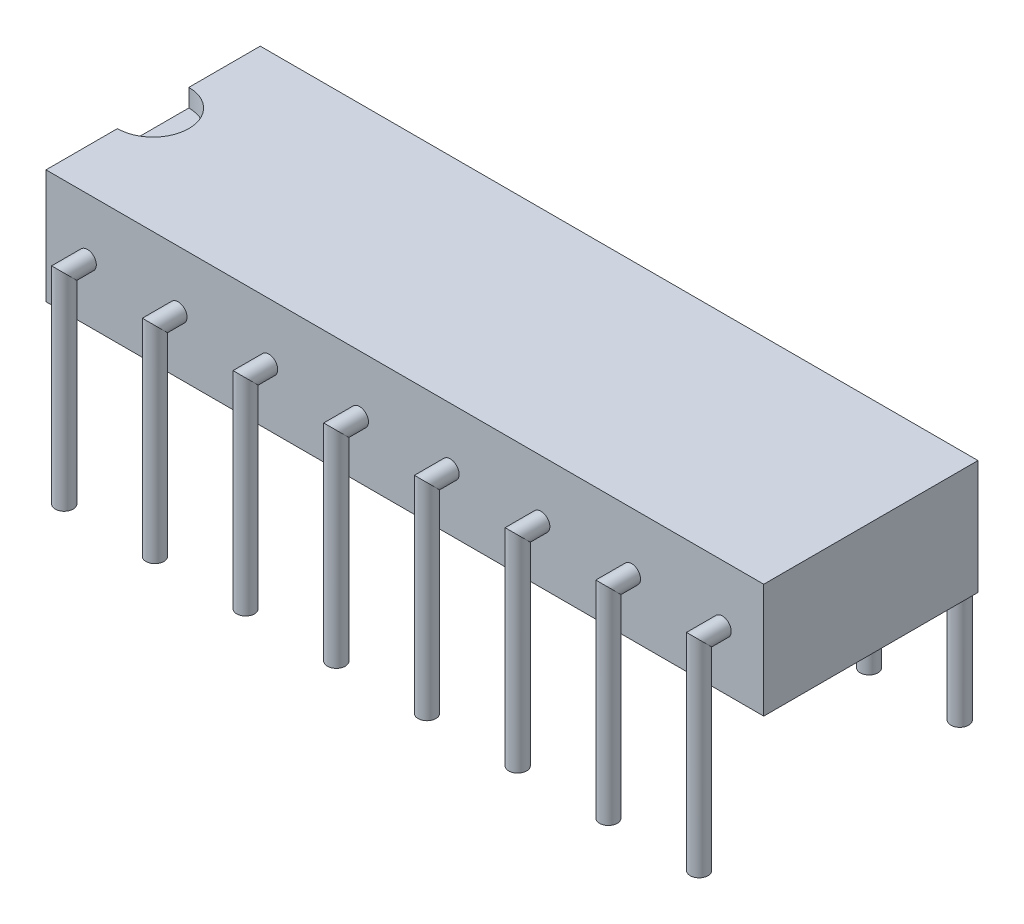
ISO-10303-21;
HEADER;
FILE_DESCRIPTION(('STEP AP214'),'2;1');
FILE_NAME('part.step','',(''),(''),'','','');
FILE_SCHEMA(('AUTOMOTIVE_DESIGN { 1 0 10303 214 1 1 1 1 }'));
ENDSEC;
DATA;
#1=APPLICATION_CONTEXT('core data for automotive mechanical design processes');
#2=APPLICATION_PROTOCOL_DEFINITION('international standard','automotive_design',2000,#1);
#3=PRODUCT_CONTEXT('',#1,'mechanical');
#4=PRODUCT('Part','Part','',(#3));
#5=PRODUCT_RELATED_PRODUCT_CATEGORY('part','',(#4));
#6=PRODUCT_DEFINITION_FORMATION('','',#4);
#7=PRODUCT_DEFINITION_CONTEXT('part definition',#1,'design');
#8=PRODUCT_DEFINITION('design','',#6,#7);
#9=PRODUCT_DEFINITION_SHAPE('','',#8);
#10=(LENGTH_UNIT() NAMED_UNIT(*) SI_UNIT(.MILLI.,.METRE.));
#11=(NAMED_UNIT(*) PLANE_ANGLE_UNIT() SI_UNIT($,.RADIAN.));
#12=(NAMED_UNIT(*) SI_UNIT($,.STERADIAN.) SOLID_ANGLE_UNIT());
#13=UNCERTAINTY_MEASURE_WITH_UNIT(LENGTH_MEASURE(1.E-05),#10,'distance_accuracy_value','');
#14=(GEOMETRIC_REPRESENTATION_CONTEXT(3) GLOBAL_UNCERTAINTY_ASSIGNED_CONTEXT((#13)) GLOBAL_UNIT_ASSIGNED_CONTEXT((#10,
#11,#12)) REPRESENTATION_CONTEXT('',''));
#15=CARTESIAN_POINT('',(0.,0.,0.));
#16=DIRECTION('',(0.,0.,1.));
#17=DIRECTION('',(1.,0.,0.));
#18=AXIS2_PLACEMENT_3D('',#15,#16,#17);
#19=CARTESIAN_POINT('',(20.1,3.2,3.));
#20=DIRECTION('',(0.,0.,-1.));
#21=DIRECTION('',(-1.,0.,0.));
#22=AXIS2_PLACEMENT_3D('',#19,#20,#21);
#23=PLANE('',#22);
#24=CARTESIAN_POINT('',(16.4,1.6,3.));
#25=DIRECTION('',(0.,0.,-1.));
#26=DIRECTION('',(-1.,0.,0.));
#27=AXIS2_PLACEMENT_3D('',#24,#25,#26);
#28=CIRCLE('',#27,0.25);
#29=CARTESIAN_POINT('',(16.15,1.6,3.));
#30=VERTEX_POINT('',#29);
#31=EDGE_CURVE('E57',#30,#30,#28,.F.);
#32=ORIENTED_EDGE('',*,*,#31,.F.);
#33=EDGE_LOOP('',(#32));
#34=FACE_BOUND('',#33,.T.);
#35=CARTESIAN_POINT('',(11.32,1.6,3.));
#36=DIRECTION('',(0.,0.,-1.));
#37=DIRECTION('',(-1.,0.,0.));
#38=AXIS2_PLACEMENT_3D('',#35,#36,#37);
#39=CIRCLE('',#38,0.25);
#40=CARTESIAN_POINT('',(11.07,1.6,3.));
#41=VERTEX_POINT('',#40);
#42=EDGE_CURVE('E160',#41,#41,#39,.F.);
#43=ORIENTED_EDGE('',*,*,#42,.F.);
#44=EDGE_LOOP('',(#43));
#45=FACE_BOUND('',#44,.T.);
#46=CARTESIAN_POINT('',(6.24,1.6,3.));
#47=DIRECTION('',(0.,0.,-1.));
#48=DIRECTION('',(-1.,0.,0.));
#49=AXIS2_PLACEMENT_3D('',#46,#47,#48);
#50=CIRCLE('',#49,0.25);
#51=CARTESIAN_POINT('',(5.99,1.6,3.));
#52=VERTEX_POINT('',#51);
#53=EDGE_CURVE('E154',#52,#52,#50,.F.);
#54=ORIENTED_EDGE('',*,*,#53,.F.);
#55=EDGE_LOOP('',(#54));
#56=FACE_BOUND('',#55,.T.);
#57=CARTESIAN_POINT('',(1.16,1.6,3.));
#58=DIRECTION('',(0.,0.,-1.));
#59=DIRECTION('',(-1.,0.,0.));
#60=AXIS2_PLACEMENT_3D('',#57,#58,#59);
#61=CIRCLE('',#60,0.25);
#62=CARTESIAN_POINT('',(0.91,1.6,3.));
#63=VERTEX_POINT('',#62);
#64=EDGE_CURVE('E148',#63,#63,#61,.F.);
#65=ORIENTED_EDGE('',*,*,#64,.F.);
#66=EDGE_LOOP('',(#65));
#67=FACE_BOUND('',#66,.T.);
#68=DIRECTION('',(0.,-1.,0.));
#69=VECTOR('',#68,1.);
#70=CARTESIAN_POINT('',(0.,3.2,3.));
#71=LINE('',#70,#69);
#72=CARTESIAN_POINT('',(0.,3.2,3.));
#73=VERTEX_POINT('',#72);
#74=CARTESIAN_POINT('',(0.,0.,3.));
#75=VERTEX_POINT('',#74);
#76=EDGE_CURVE('E184',#73,#75,#71,.T.);
#77=ORIENTED_EDGE('',*,*,#76,.T.);
#78=DIRECTION('',(-1.,0.,0.));
#79=VECTOR('',#78,1.);
#80=CARTESIAN_POINT('',(20.1,0.,3.));
#81=LINE('',#80,#79);
#82=CARTESIAN_POINT('',(20.1,0.,3.));
#83=VERTEX_POINT('',#82);
#84=EDGE_CURVE('E145',#83,#75,#81,.T.);
#85=ORIENTED_EDGE('',*,*,#84,.F.);
#86=DIRECTION('',(0.,-1.,0.));
#87=VECTOR('',#86,1.);
#88=CARTESIAN_POINT('',(20.1,3.2,3.));
#89=LINE('',#88,#87);
#90=CARTESIAN_POINT('',(20.1,3.2,3.));
#91=VERTEX_POINT('',#90);
#92=EDGE_CURVE('E125',#91,#83,#89,.T.);
#93=ORIENTED_EDGE('',*,*,#92,.F.);
#94=DIRECTION('',(-1.,0.,0.));
#95=VECTOR('',#94,1.);
#96=CARTESIAN_POINT('',(20.1,3.2,3.));
#97=LINE('',#96,#95);
#98=EDGE_CURVE('E138',#91,#73,#97,.T.);
#99=ORIENTED_EDGE('',*,*,#98,.T.);
#100=EDGE_LOOP('',(#77,#85,#93,#99));
#101=FACE_BOUND('',#100,.T.);
#102=CARTESIAN_POINT('',(3.7,1.6,3.));
#103=DIRECTION('',(0.,0.,-1.));
#104=DIRECTION('',(-1.,0.,0.));
#105=AXIS2_PLACEMENT_3D('',#102,#103,#104);
#106=CIRCLE('',#105,0.25);
#107=CARTESIAN_POINT('',(3.45,1.6,3.));
#108=VERTEX_POINT('',#107);
#109=EDGE_CURVE('E151',#108,#108,#106,.F.);
#110=ORIENTED_EDGE('',*,*,#109,.F.);
#111=EDGE_LOOP('',(#110));
#112=FACE_BOUND('',#111,.T.);
#113=CARTESIAN_POINT('',(8.78,1.6,3.));
#114=DIRECTION('',(0.,0.,-1.));
#115=DIRECTION('',(-1.,0.,0.));
#116=AXIS2_PLACEMENT_3D('',#113,#114,#115);
#117=CIRCLE('',#116,0.25);
#118=CARTESIAN_POINT('',(8.53,1.6,3.));
#119=VERTEX_POINT('',#118);
#120=EDGE_CURVE('E157',#119,#119,#117,.F.);
#121=ORIENTED_EDGE('',*,*,#120,.F.);
#122=EDGE_LOOP('',(#121));
#123=FACE_BOUND('',#122,.T.);
#124=CARTESIAN_POINT('',(13.86,1.6,3.));
#125=DIRECTION('',(0.,0.,-1.));
#126=DIRECTION('',(-1.,0.,0.));
#127=AXIS2_PLACEMENT_3D('',#124,#125,#126);
#128=CIRCLE('',#127,0.25);
#129=CARTESIAN_POINT('',(13.61,1.6,3.));
#130=VERTEX_POINT('',#129);
#131=EDGE_CURVE('E163',#130,#130,#128,.F.);
#132=ORIENTED_EDGE('',*,*,#131,.F.);
#133=EDGE_LOOP('',(#132));
#134=FACE_BOUND('',#133,.T.);
#135=CARTESIAN_POINT('',(18.94,1.6,3.));
#136=DIRECTION('',(0.,0.,-1.));
#137=DIRECTION('',(-1.,0.,0.));
#138=AXIS2_PLACEMENT_3D('',#135,#136,#137);
#139=CIRCLE('',#138,0.25);
#140=CARTESIAN_POINT('',(18.69,1.6,3.));
#141=VERTEX_POINT('',#140);
#142=EDGE_CURVE('E12',#141,#141,#139,.F.);
#143=ORIENTED_EDGE('',*,*,#142,.F.);
#144=EDGE_LOOP('',(#143));
#145=FACE_BOUND('',#144,.T.);
#146=ADVANCED_FACE('F50',(#34,#45,#56,#67,#101,#112,#123,#134,#145),#23,.F.);
#147=CARTESIAN_POINT('',(20.1,0.,3.));
#148=DIRECTION('',(0.,1.,0.));
#149=DIRECTION('',(0.,0.,1.));
#150=AXIS2_PLACEMENT_3D('',#147,#148,#149);
#151=PLANE('',#150);
#152=DIRECTION('',(0.,0.,-1.));
#153=VECTOR('',#152,1.);
#154=CARTESIAN_POINT('',(0.,0.,3.));
#155=LINE('',#154,#153);
#156=CARTESIAN_POINT('',(0.,0.,-3.));
#157=VERTEX_POINT('',#156);
#158=EDGE_CURVE('E266',#75,#157,#155,.T.);
#159=ORIENTED_EDGE('',*,*,#158,.T.);
#160=DIRECTION('',(-1.,0.,0.));
#161=VECTOR('',#160,1.);
#162=CARTESIAN_POINT('',(20.1,0.,-3.));
#163=LINE('',#162,#161);
#164=CARTESIAN_POINT('',(20.1,0.,-3.));
#165=VERTEX_POINT('',#164);
#166=EDGE_CURVE('E142',#165,#157,#163,.T.);
#167=ORIENTED_EDGE('',*,*,#166,.F.);
#168=DIRECTION('',(0.,0.,-1.));
#169=VECTOR('',#168,1.);
#170=CARTESIAN_POINT('',(20.1,0.,3.));
#171=LINE('',#170,#169);
#172=EDGE_CURVE('E128',#83,#165,#171,.T.);
#173=ORIENTED_EDGE('',*,*,#172,.F.);
#174=ORIENTED_EDGE('',*,*,#84,.T.);
#175=EDGE_LOOP('',(#159,#167,#173,#174));
#176=FACE_BOUND('',#175,.T.);
#177=ADVANCED_FACE('F173',(#176),#151,.F.);
#178=CARTESIAN_POINT('',(20.1,3.2,-3.));
#179=DIRECTION('',(0.,0.,1.));
#180=DIRECTION('',(1.,0.,0.));
#181=AXIS2_PLACEMENT_3D('',#178,#179,#180);
#182=PLANE('',#181);
#183=CARTESIAN_POINT('',(18.94,1.6,-3.));
#184=DIRECTION('',(0.,0.,1.));
#185=DIRECTION('',(1.,0.,0.));
#186=AXIS2_PLACEMENT_3D('',#183,#184,#185);
#187=CIRCLE('',#186,0.25);
#188=CARTESIAN_POINT('',(19.19,1.6,-3.));
#189=VERTEX_POINT('',#188);
#190=EDGE_CURVE('E813',#189,#189,#187,.T.);
#191=ORIENTED_EDGE('',*,*,#190,.T.);
#192=EDGE_LOOP('',(#191));
#193=FACE_BOUND('',#192,.T.);
#194=CARTESIAN_POINT('',(16.4,1.6,-3.));
#195=DIRECTION('',(0.,0.,1.));
#196=DIRECTION('',(1.,0.,0.));
#197=AXIS2_PLACEMENT_3D('',#194,#195,#196);
#198=CIRCLE('',#197,0.25);
#199=CARTESIAN_POINT('',(16.65,1.6,-3.));
#200=VERTEX_POINT('',#199);
#201=EDGE_CURVE('E806',#200,#200,#198,.T.);
#202=ORIENTED_EDGE('',*,*,#201,.T.);
#203=EDGE_LOOP('',(#202));
#204=FACE_BOUND('',#203,.T.);
#205=CARTESIAN_POINT('',(13.86,1.6,-3.));
#206=DIRECTION('',(0.,0.,1.));
#207=DIRECTION('',(1.,0.,0.));
#208=AXIS2_PLACEMENT_3D('',#205,#206,#207);
#209=CIRCLE('',#208,0.25);
#210=CARTESIAN_POINT('',(14.11,1.6,-3.));
#211=VERTEX_POINT('',#210);
#212=EDGE_CURVE('E822',#211,#211,#209,.T.);
#213=ORIENTED_EDGE('',*,*,#212,.T.);
#214=EDGE_LOOP('',(#213));
#215=FACE_BOUND('',#214,.T.);
#216=CARTESIAN_POINT('',(11.32,1.6,-3.));
#217=DIRECTION('',(0.,0.,1.));
#218=DIRECTION('',(1.,0.,0.));
#219=AXIS2_PLACEMENT_3D('',#216,#217,#218);
#220=CIRCLE('',#219,0.25);
#221=CARTESIAN_POINT('',(11.57,1.6,-3.));
#222=VERTEX_POINT('',#221);
#223=EDGE_CURVE('E831',#222,#222,#220,.T.);
#224=ORIENTED_EDGE('',*,*,#223,.T.);
#225=EDGE_LOOP('',(#224));
#226=FACE_BOUND('',#225,.T.);
#227=CARTESIAN_POINT('',(8.78,1.6,-3.));
#228=DIRECTION('',(0.,0.,1.));
#229=DIRECTION('',(1.,0.,0.));
#230=AXIS2_PLACEMENT_3D('',#227,#228,#229);
#231=CIRCLE('',#230,0.25);
#232=CARTESIAN_POINT('',(9.03,1.6,-3.));
#233=VERTEX_POINT('',#232);
#234=EDGE_CURVE('E840',#233,#233,#231,.T.);
#235=ORIENTED_EDGE('',*,*,#234,.T.);
#236=EDGE_LOOP('',(#235));
#237=FACE_BOUND('',#236,.T.);
#238=CARTESIAN_POINT('',(6.24,1.6,-3.));
#239=DIRECTION('',(0.,0.,1.));
#240=DIRECTION('',(1.,0.,0.));
#241=AXIS2_PLACEMENT_3D('',#238,#239,#240);
#242=CIRCLE('',#241,0.25);
#243=CARTESIAN_POINT('',(6.49,1.6,-3.));
#244=VERTEX_POINT('',#243);
#245=EDGE_CURVE('E849',#244,#244,#242,.T.);
#246=ORIENTED_EDGE('',*,*,#245,.T.);
#247=EDGE_LOOP('',(#246));
#248=FACE_BOUND('',#247,.T.);
#249=CARTESIAN_POINT('',(3.7,1.6,-3.));
#250=DIRECTION('',(0.,0.,1.));
#251=DIRECTION('',(1.,0.,0.));
#252=AXIS2_PLACEMENT_3D('',#249,#250,#251);
#253=CIRCLE('',#252,0.25);
#254=CARTESIAN_POINT('',(3.95,1.6,-3.));
#255=VERTEX_POINT('',#254);
#256=EDGE_CURVE('E858',#255,#255,#253,.T.);
#257=ORIENTED_EDGE('',*,*,#256,.T.);
#258=EDGE_LOOP('',(#257));
#259=FACE_BOUND('',#258,.T.);
#260=CARTESIAN_POINT('',(1.16,1.6,-3.));
#261=DIRECTION('',(0.,0.,1.));
#262=DIRECTION('',(1.,0.,0.));
#263=AXIS2_PLACEMENT_3D('',#260,#261,#262);
#264=CIRCLE('',#263,0.25);
#265=CARTESIAN_POINT('',(1.41,1.6,-3.));
#266=VERTEX_POINT('',#265);
#267=EDGE_CURVE('E249',#266,#266,#264,.T.);
#268=ORIENTED_EDGE('',*,*,#267,.T.);
#269=EDGE_LOOP('',(#268));
#270=FACE_BOUND('',#269,.T.);
#271=DIRECTION('',(0.,1.,0.));
#272=VECTOR('',#271,1.);
#273=CARTESIAN_POINT('',(0.,3.2,-3.));
#274=LINE('',#273,#272);
#275=CARTESIAN_POINT('',(0.,3.2,-3.));
#276=VERTEX_POINT('',#275);
#277=EDGE_CURVE('E130',#157,#276,#274,.T.);
#278=ORIENTED_EDGE('',*,*,#277,.T.);
#279=DIRECTION('',(-1.,0.,0.));
#280=VECTOR('',#279,1.);
#281=CARTESIAN_POINT('',(20.1,3.2,-3.));
#282=LINE('',#281,#280);
#283=CARTESIAN_POINT('',(20.1,3.2,-3.));
#284=VERTEX_POINT('',#283);
#285=EDGE_CURVE('E124',#284,#276,#282,.T.);
#286=ORIENTED_EDGE('',*,*,#285,.F.);
#287=DIRECTION('',(0.,1.,0.));
#288=VECTOR('',#287,1.);
#289=CARTESIAN_POINT('',(20.1,3.2,-3.));
#290=LINE('',#289,#288);
#291=EDGE_CURVE('E135',#165,#284,#290,.T.);
#292=ORIENTED_EDGE('',*,*,#291,.F.);
#293=ORIENTED_EDGE('',*,*,#166,.T.);
#294=EDGE_LOOP('',(#278,#286,#292,#293));
#295=FACE_BOUND('',#294,.T.);
#296=ADVANCED_FACE('F270',(#193,#204,#215,#226,#237,#248,#259,#270,#295),#182,.F.);
#297=CARTESIAN_POINT('',(20.1,3.2,3.));
#298=DIRECTION('',(0.,-1.,0.));
#299=DIRECTION('',(0.,0.,-1.));
#300=AXIS2_PLACEMENT_3D('',#297,#298,#299);
#301=PLANE('',#300);
#302=DIRECTION('',(0.,0.,1.));
#303=VECTOR('',#302,1.);
#304=CARTESIAN_POINT('',(0.,3.2,3.));
#305=LINE('',#304,#303);
#306=CARTESIAN_POINT('',(0.,3.2,-1.));
#307=VERTEX_POINT('',#306);
#308=EDGE_CURVE('E118',#276,#307,#305,.T.);
#309=ORIENTED_EDGE('',*,*,#308,.T.);
#310=CARTESIAN_POINT('',(0.,3.2,0.));
#311=DIRECTION('',(0.,1.,0.));
#312=DIRECTION('',(0.,0.,1.));
#313=AXIS2_PLACEMENT_3D('',#310,#311,#312);
#314=CIRCLE('',#313,1.);
#315=CARTESIAN_POINT('',(0.,3.2,1.));
#316=VERTEX_POINT('',#315);
#317=EDGE_CURVE('E102',#316,#307,#314,.T.);
#318=ORIENTED_EDGE('',*,*,#317,.F.);
#319=EDGE_CURVE('E126',#316,#73,#305,.T.);
#320=ORIENTED_EDGE('',*,*,#319,.T.);
#321=ORIENTED_EDGE('',*,*,#98,.F.);
#322=DIRECTION('',(0.,0.,1.));
#323=VECTOR('',#322,1.);
#324=CARTESIAN_POINT('',(20.1,3.2,3.));
#325=LINE('',#324,#323);
#326=EDGE_CURVE('E71',#284,#91,#325,.T.);
#327=ORIENTED_EDGE('',*,*,#326,.F.);
#328=ORIENTED_EDGE('',*,*,#285,.T.);
#329=EDGE_LOOP('',(#309,#318,#320,#321,#327,#328));
#330=FACE_BOUND('',#329,.T.);
#331=ADVANCED_FACE('F122',(#330),#301,.F.);
#332=CARTESIAN_POINT('',(20.1,0.,3.));
#333=DIRECTION('',(1.,0.,0.));
#334=DIRECTION('',(0.,0.,-1.));
#335=AXIS2_PLACEMENT_3D('',#332,#333,#334);
#336=PLANE('',#335);
#337=ORIENTED_EDGE('',*,*,#92,.T.);
#338=ORIENTED_EDGE('',*,*,#172,.T.);
#339=ORIENTED_EDGE('',*,*,#291,.T.);
#340=ORIENTED_EDGE('',*,*,#326,.T.);
#341=EDGE_LOOP('',(#337,#338,#339,#340));
#342=FACE_BOUND('',#341,.T.);
#343=ADVANCED_FACE('F273',(#342),#336,.T.);
#344=CARTESIAN_POINT('',(0.,0.,3.));
#345=DIRECTION('',(1.,0.,0.));
#346=DIRECTION('',(0.,0.,-1.));
#347=AXIS2_PLACEMENT_3D('',#344,#345,#346);
#348=PLANE('',#347);
#349=DIRECTION('',(0.,0.,1.));
#350=VECTOR('',#349,1.);
#351=CARTESIAN_POINT('',(0.,2.7,-1.));
#352=LINE('',#351,#350);
#353=CARTESIAN_POINT('',(0.,2.7,-1.));
#354=VERTEX_POINT('',#353);
#355=CARTESIAN_POINT('',(0.,2.7,1.));
#356=VERTEX_POINT('',#355);
#357=EDGE_CURVE('E119',#354,#356,#352,.T.);
#358=ORIENTED_EDGE('',*,*,#357,.F.);
#359=DIRECTION('',(0.,1.,0.));
#360=VECTOR('',#359,1.);
#361=CARTESIAN_POINT('',(0.,2.7,-1.));
#362=LINE('',#361,#360);
#363=EDGE_CURVE('E105',#354,#307,#362,.T.);
#364=ORIENTED_EDGE('',*,*,#363,.T.);
#365=ORIENTED_EDGE('',*,*,#308,.F.);
#366=ORIENTED_EDGE('',*,*,#277,.F.);
#367=ORIENTED_EDGE('',*,*,#158,.F.);
#368=ORIENTED_EDGE('',*,*,#76,.F.);
#369=ORIENTED_EDGE('',*,*,#319,.F.);
#370=DIRECTION('',(0.,1.,0.));
#371=VECTOR('',#370,1.);
#372=CARTESIAN_POINT('',(0.,2.7,1.));
#373=LINE('',#372,#371);
#374=EDGE_CURVE('E108',#356,#316,#373,.T.);
#375=ORIENTED_EDGE('',*,*,#374,.F.);
#376=EDGE_LOOP('',(#358,#364,#365,#366,#367,#368,#369,#375));
#377=FACE_BOUND('',#376,.T.);
#378=ADVANCED_FACE('F116',(#377),#348,.F.);
#379=CARTESIAN_POINT('',(0.,2.7,0.));
#380=DIRECTION('',(0.,1.,0.));
#381=DIRECTION('',(0.,0.,1.));
#382=AXIS2_PLACEMENT_3D('',#379,#380,#381);
#383=CYLINDRICAL_SURFACE('',#382,1.);
#384=ORIENTED_EDGE('',*,*,#317,.T.);
#385=ORIENTED_EDGE('',*,*,#363,.F.);
#386=CARTESIAN_POINT('',(0.,2.7,0.));
#387=DIRECTION('',(0.,1.,0.));
#388=DIRECTION('',(0.,0.,1.));
#389=AXIS2_PLACEMENT_3D('',#386,#387,#388);
#390=CIRCLE('',#389,1.);
#391=EDGE_CURVE('E63',#356,#354,#390,.T.);
#392=ORIENTED_EDGE('',*,*,#391,.F.);
#393=ORIENTED_EDGE('',*,*,#374,.T.);
#394=EDGE_LOOP('',(#384,#385,#392,#393));
#395=FACE_BOUND('',#394,.T.);
#396=ADVANCED_FACE('F104',(#395),#383,.F.);
#397=CARTESIAN_POINT('',(0.,2.7,0.));
#398=DIRECTION('',(0.,1.,0.));
#399=DIRECTION('',(0.,0.,1.));
#400=AXIS2_PLACEMENT_3D('',#397,#398,#399);
#401=PLANE('',#400);
#402=ORIENTED_EDGE('',*,*,#391,.T.);
#403=ORIENTED_EDGE('',*,*,#357,.T.);
#404=EDGE_LOOP('',(#402,#403));
#405=FACE_BOUND('',#404,.T.);
#406=ADVANCED_FACE('F317',(#405),#401,.T.);
#407=CARTESIAN_POINT('',(1.16,1.6,3.65));
#408=DIRECTION('',(0.,-1.,0.));
#409=DIRECTION('',(0.,0.,-1.));
#410=AXIS2_PLACEMENT_3D('',#407,#408,#409);
#411=CYLINDRICAL_SURFACE('',#410,0.25);
#412=CARTESIAN_POINT('',(1.16,1.6,3.65));
#413=DIRECTION('',(0.,-0.707106781186548,0.707106781186547));
#414=DIRECTION('',(0.,-0.707106781186547,-0.707106781186548));
#415=AXIS2_PLACEMENT_3D('',#412,#413,#414);
#416=ELLIPSE('',#415,0.353553390593274,0.25);
#417=CARTESIAN_POINT('',(1.16,1.35,3.4));
#418=VERTEX_POINT('',#417);
#419=EDGE_CURVE('E258',#418,#418,#416,.T.);
#420=ORIENTED_EDGE('',*,*,#419,.T.);
#421=EDGE_LOOP('',(#420));
#422=FACE_BOUND('',#421,.T.);
#423=CARTESIAN_POINT('',(1.16,-4.,3.65));
#424=DIRECTION('',(0.,-1.,0.));
#425=DIRECTION('',(0.,0.,-1.));
#426=AXIS2_PLACEMENT_3D('',#423,#424,#425);
#427=CIRCLE('',#426,0.25);
#428=CARTESIAN_POINT('',(1.16,-4.,3.4));
#429=VERTEX_POINT('',#428);
#430=EDGE_CURVE('E112',#429,#429,#427,.F.);
#431=ORIENTED_EDGE('',*,*,#430,.T.);
#432=EDGE_LOOP('',(#431));
#433=FACE_BOUND('',#432,.T.);
#434=ADVANCED_FACE('F325',(#422,#433),#411,.T.);
#435=CARTESIAN_POINT('',(1.16,1.6,4.35710678118655));
#436=DIRECTION('',(0.,0.,-1.));
#437=DIRECTION('',(0.,1.,0.));
#438=AXIS2_PLACEMENT_3D('',#435,#436,#437);
#439=CYLINDRICAL_SURFACE('',#438,0.25);
#440=ORIENTED_EDGE('',*,*,#64,.T.);
#441=EDGE_LOOP('',(#440));
#442=FACE_BOUND('',#441,.T.);
#443=ORIENTED_EDGE('',*,*,#419,.F.);
#444=EDGE_LOOP('',(#443));
#445=FACE_BOUND('',#444,.T.);
#446=ADVANCED_FACE('F334',(#442,#445),#439,.T.);
#447=CARTESIAN_POINT('',(1.16,-4.,3.65));
#448=DIRECTION('',(0.,-1.,0.));
#449=DIRECTION('',(0.,0.,-1.));
#450=AXIS2_PLACEMENT_3D('',#447,#448,#449);
#451=PLANE('',#450);
#452=ORIENTED_EDGE('',*,*,#430,.F.);
#453=EDGE_LOOP('',(#452));
#454=FACE_BOUND('',#453,.T.);
#455=ADVANCED_FACE('F344',(#454),#451,.T.);
#456=CARTESIAN_POINT('',(1.16,1.6,-3.65));
#457=DIRECTION('',(0.,-1.,0.));
#458=DIRECTION('',(0.,0.,-1.));
#459=AXIS2_PLACEMENT_3D('',#456,#457,#458);
#460=CYLINDRICAL_SURFACE('',#459,0.25);
#461=CARTESIAN_POINT('',(1.16,1.6,-3.65));
#462=DIRECTION('',(0.,-0.707106781186548,-0.707106781186547));
#463=DIRECTION('',(0.,-0.707106781186547,0.707106781186548));
#464=AXIS2_PLACEMENT_3D('',#461,#462,#463);
#465=ELLIPSE('',#464,0.353553390593274,0.25);
#466=CARTESIAN_POINT('',(1.16,1.35,-3.4));
#467=VERTEX_POINT('',#466);
#468=EDGE_CURVE('E252',#467,#467,#465,.F.);
#469=ORIENTED_EDGE('',*,*,#468,.F.);
#470=EDGE_LOOP('',(#469));
#471=FACE_BOUND('',#470,.T.);
#472=CARTESIAN_POINT('',(1.16,-4.,-3.65));
#473=DIRECTION('',(0.,-1.,0.));
#474=DIRECTION('',(0.,0.,-1.));
#475=AXIS2_PLACEMENT_3D('',#472,#473,#474);
#476=CIRCLE('',#475,0.25);
#477=CARTESIAN_POINT('',(1.16,-4.,-3.9));
#478=VERTEX_POINT('',#477);
#479=EDGE_CURVE('E255',#478,#478,#476,.T.);
#480=ORIENTED_EDGE('',*,*,#479,.F.);
#481=EDGE_LOOP('',(#480));
#482=FACE_BOUND('',#481,.T.);
#483=ADVANCED_FACE('F354',(#471,#482),#460,.T.);
#484=CARTESIAN_POINT('',(1.16,1.6,-4.35710678118655));
#485=DIRECTION('',(0.,0.,1.));
#486=DIRECTION('',(0.,-1.,0.));
#487=AXIS2_PLACEMENT_3D('',#484,#485,#486);
#488=CYLINDRICAL_SURFACE('',#487,0.25);
#489=ORIENTED_EDGE('',*,*,#267,.F.);
#490=EDGE_LOOP('',(#489));
#491=FACE_BOUND('',#490,.T.);
#492=ORIENTED_EDGE('',*,*,#468,.T.);
#493=EDGE_LOOP('',(#492));
#494=FACE_BOUND('',#493,.T.);
#495=ADVANCED_FACE('F364',(#491,#494),#488,.T.);
#496=CARTESIAN_POINT('',(1.16,-4.,-3.65));
#497=DIRECTION('',(0.,-1.,0.));
#498=DIRECTION('',(0.,0.,-1.));
#499=AXIS2_PLACEMENT_3D('',#496,#497,#498);
#500=PLANE('',#499);
#501=ORIENTED_EDGE('',*,*,#479,.T.);
#502=EDGE_LOOP('',(#501));
#503=FACE_BOUND('',#502,.T.);
#504=ADVANCED_FACE('F374',(#503),#500,.T.);
#505=CARTESIAN_POINT('',(3.7,1.6,3.65));
#506=DIRECTION('',(0.,-1.,0.));
#507=DIRECTION('',(0.,0.,-1.));
#508=AXIS2_PLACEMENT_3D('',#505,#506,#507);
#509=CYLINDRICAL_SURFACE('',#508,0.25);
#510=CARTESIAN_POINT('',(3.7,1.6,3.65));
#511=DIRECTION('',(0.,-0.707106781186548,0.707106781186547));
#512=DIRECTION('',(0.,-0.707106781186547,-0.707106781186548));
#513=AXIS2_PLACEMENT_3D('',#510,#511,#512);
#514=ELLIPSE('',#513,0.353553390593274,0.25);
#515=CARTESIAN_POINT('',(3.7,1.35,3.4));
#516=VERTEX_POINT('',#515);
#517=EDGE_CURVE('E243',#516,#516,#514,.T.);
#518=ORIENTED_EDGE('',*,*,#517,.T.);
#519=EDGE_LOOP('',(#518));
#520=FACE_BOUND('',#519,.T.);
#521=CARTESIAN_POINT('',(3.7,-4.,3.65));
#522=DIRECTION('',(0.,-1.,0.));
#523=DIRECTION('',(0.,0.,-1.));
#524=AXIS2_PLACEMENT_3D('',#521,#522,#523);
#525=CIRCLE('',#524,0.25);
#526=CARTESIAN_POINT('',(3.7,-4.,3.4));
#527=VERTEX_POINT('',#526);
#528=EDGE_CURVE('E246',#527,#527,#525,.F.);
#529=ORIENTED_EDGE('',*,*,#528,.T.);
#530=EDGE_LOOP('',(#529));
#531=FACE_BOUND('',#530,.T.);
#532=ADVANCED_FACE('F383',(#520,#531),#509,.T.);
#533=CARTESIAN_POINT('',(3.7,1.6,4.35710678118655));
#534=DIRECTION('',(0.,0.,-1.));
#535=DIRECTION('',(0.,1.,0.));
#536=AXIS2_PLACEMENT_3D('',#533,#534,#535);
#537=CYLINDRICAL_SURFACE('',#536,0.25);
#538=ORIENTED_EDGE('',*,*,#109,.T.);
#539=EDGE_LOOP('',(#538));
#540=FACE_BOUND('',#539,.T.);
#541=ORIENTED_EDGE('',*,*,#517,.F.);
#542=EDGE_LOOP('',(#541));
#543=FACE_BOUND('',#542,.T.);
#544=ADVANCED_FACE('F398',(#540,#543),#537,.T.);
#545=CARTESIAN_POINT('',(3.7,-4.,3.65));
#546=DIRECTION('',(0.,-1.,0.));
#547=DIRECTION('',(0.,0.,-1.));
#548=AXIS2_PLACEMENT_3D('',#545,#546,#547);
#549=PLANE('',#548);
#550=ORIENTED_EDGE('',*,*,#528,.F.);
#551=EDGE_LOOP('',(#550));
#552=FACE_BOUND('',#551,.T.);
#553=ADVANCED_FACE('F407',(#552),#549,.T.);
#554=CARTESIAN_POINT('',(6.24,1.6,3.65));
#555=DIRECTION('',(0.,-1.,0.));
#556=DIRECTION('',(0.,0.,-1.));
#557=AXIS2_PLACEMENT_3D('',#554,#555,#556);
#558=CYLINDRICAL_SURFACE('',#557,0.25);
#559=CARTESIAN_POINT('',(6.24,1.6,3.65));
#560=DIRECTION('',(0.,-0.707106781186548,0.707106781186547));
#561=DIRECTION('',(0.,-0.707106781186547,-0.707106781186548));
#562=AXIS2_PLACEMENT_3D('',#559,#560,#561);
#563=ELLIPSE('',#562,0.353553390593274,0.25);
#564=CARTESIAN_POINT('',(6.24,1.35,3.4));
#565=VERTEX_POINT('',#564);
#566=EDGE_CURVE('E237',#565,#565,#563,.T.);
#567=ORIENTED_EDGE('',*,*,#566,.T.);
#568=EDGE_LOOP('',(#567));
#569=FACE_BOUND('',#568,.T.);
#570=CARTESIAN_POINT('',(6.24,-4.,3.65));
#571=DIRECTION('',(0.,-1.,0.));
#572=DIRECTION('',(0.,0.,-1.));
#573=AXIS2_PLACEMENT_3D('',#570,#571,#572);
#574=CIRCLE('',#573,0.25);
#575=CARTESIAN_POINT('',(6.24,-4.,3.4));
#576=VERTEX_POINT('',#575);
#577=EDGE_CURVE('E240',#576,#576,#574,.F.);
#578=ORIENTED_EDGE('',*,*,#577,.T.);
#579=EDGE_LOOP('',(#578));
#580=FACE_BOUND('',#579,.T.);
#581=ADVANCED_FACE('F416',(#569,#580),#558,.T.);
#582=CARTESIAN_POINT('',(6.24,1.6,4.35710678118655));
#583=DIRECTION('',(0.,0.,-1.));
#584=DIRECTION('',(0.,1.,0.));
#585=AXIS2_PLACEMENT_3D('',#582,#583,#584);
#586=CYLINDRICAL_SURFACE('',#585,0.25);
#587=ORIENTED_EDGE('',*,*,#53,.T.);
#588=EDGE_LOOP('',(#587));
#589=FACE_BOUND('',#588,.T.);
#590=ORIENTED_EDGE('',*,*,#566,.F.);
#591=EDGE_LOOP('',(#590));
#592=FACE_BOUND('',#591,.T.);
#593=ADVANCED_FACE('F425',(#589,#592),#586,.T.);
#594=CARTESIAN_POINT('',(6.24,-4.,3.65));
#595=DIRECTION('',(0.,-1.,0.));
#596=DIRECTION('',(0.,0.,-1.));
#597=AXIS2_PLACEMENT_3D('',#594,#595,#596);
#598=PLANE('',#597);
#599=ORIENTED_EDGE('',*,*,#577,.F.);
#600=EDGE_LOOP('',(#599));
#601=FACE_BOUND('',#600,.T.);
#602=ADVANCED_FACE('F434',(#601),#598,.T.);
#603=CARTESIAN_POINT('',(8.78,1.6,3.65));
#604=DIRECTION('',(0.,-1.,0.));
#605=DIRECTION('',(0.,0.,-1.));
#606=AXIS2_PLACEMENT_3D('',#603,#604,#605);
#607=CYLINDRICAL_SURFACE('',#606,0.25);
#608=CARTESIAN_POINT('',(8.78,1.6,3.65));
#609=DIRECTION('',(0.,-0.707106781186548,0.707106781186547));
#610=DIRECTION('',(0.,-0.707106781186547,-0.707106781186548));
#611=AXIS2_PLACEMENT_3D('',#608,#609,#610);
#612=ELLIPSE('',#611,0.353553390593274,0.25);
#613=CARTESIAN_POINT('',(8.78,1.35,3.4));
#614=VERTEX_POINT('',#613);
#615=EDGE_CURVE('E231',#614,#614,#612,.T.);
#616=ORIENTED_EDGE('',*,*,#615,.T.);
#617=EDGE_LOOP('',(#616));
#618=FACE_BOUND('',#617,.T.);
#619=CARTESIAN_POINT('',(8.78,-4.,3.65));
#620=DIRECTION('',(0.,-1.,0.));
#621=DIRECTION('',(0.,0.,-1.));
#622=AXIS2_PLACEMENT_3D('',#619,#620,#621);
#623=CIRCLE('',#622,0.25);
#624=CARTESIAN_POINT('',(8.78,-4.,3.4));
#625=VERTEX_POINT('',#624);
#626=EDGE_CURVE('E234',#625,#625,#623,.F.);
#627=ORIENTED_EDGE('',*,*,#626,.T.);
#628=EDGE_LOOP('',(#627));
#629=FACE_BOUND('',#628,.T.);
#630=ADVANCED_FACE('F443',(#618,#629),#607,.T.);
#631=CARTESIAN_POINT('',(8.78,1.6,4.35710678118655));
#632=DIRECTION('',(0.,0.,-1.));
#633=DIRECTION('',(0.,1.,0.));
#634=AXIS2_PLACEMENT_3D('',#631,#632,#633);
#635=CYLINDRICAL_SURFACE('',#634,0.25);
#636=ORIENTED_EDGE('',*,*,#120,.T.);
#637=EDGE_LOOP('',(#636));
#638=FACE_BOUND('',#637,.T.);
#639=ORIENTED_EDGE('',*,*,#615,.F.);
#640=EDGE_LOOP('',(#639));
#641=FACE_BOUND('',#640,.T.);
#642=ADVANCED_FACE('F452',(#638,#641),#635,.T.);
#643=CARTESIAN_POINT('',(8.78,-4.,3.65));
#644=DIRECTION('',(0.,-1.,0.));
#645=DIRECTION('',(0.,0.,-1.));
#646=AXIS2_PLACEMENT_3D('',#643,#644,#645);
#647=PLANE('',#646);
#648=ORIENTED_EDGE('',*,*,#626,.F.);
#649=EDGE_LOOP('',(#648));
#650=FACE_BOUND('',#649,.T.);
#651=ADVANCED_FACE('F461',(#650),#647,.T.);
#652=CARTESIAN_POINT('',(11.32,1.6,3.65));
#653=DIRECTION('',(0.,-1.,0.));
#654=DIRECTION('',(0.,0.,-1.));
#655=AXIS2_PLACEMENT_3D('',#652,#653,#654);
#656=CYLINDRICAL_SURFACE('',#655,0.25);
#657=CARTESIAN_POINT('',(11.32,1.6,3.65));
#658=DIRECTION('',(0.,-0.707106781186548,0.707106781186547));
#659=DIRECTION('',(0.,-0.707106781186547,-0.707106781186548));
#660=AXIS2_PLACEMENT_3D('',#657,#658,#659);
#661=ELLIPSE('',#660,0.353553390593274,0.25);
#662=CARTESIAN_POINT('',(11.32,1.35,3.4));
#663=VERTEX_POINT('',#662);
#664=EDGE_CURVE('E225',#663,#663,#661,.T.);
#665=ORIENTED_EDGE('',*,*,#664,.T.);
#666=EDGE_LOOP('',(#665));
#667=FACE_BOUND('',#666,.T.);
#668=CARTESIAN_POINT('',(11.32,-4.,3.65));
#669=DIRECTION('',(0.,-1.,0.));
#670=DIRECTION('',(0.,0.,-1.));
#671=AXIS2_PLACEMENT_3D('',#668,#669,#670);
#672=CIRCLE('',#671,0.25);
#673=CARTESIAN_POINT('',(11.32,-4.,3.4));
#674=VERTEX_POINT('',#673);
#675=EDGE_CURVE('E228',#674,#674,#672,.F.);
#676=ORIENTED_EDGE('',*,*,#675,.T.);
#677=EDGE_LOOP('',(#676));
#678=FACE_BOUND('',#677,.T.);
#679=ADVANCED_FACE('F470',(#667,#678),#656,.T.);
#680=CARTESIAN_POINT('',(11.32,1.6,4.35710678118655));
#681=DIRECTION('',(0.,0.,-1.));
#682=DIRECTION('',(0.,1.,0.));
#683=AXIS2_PLACEMENT_3D('',#680,#681,#682);
#684=CYLINDRICAL_SURFACE('',#683,0.25);
#685=ORIENTED_EDGE('',*,*,#42,.T.);
#686=EDGE_LOOP('',(#685));
#687=FACE_BOUND('',#686,.T.);
#688=ORIENTED_EDGE('',*,*,#664,.F.);
#689=EDGE_LOOP('',(#688));
#690=FACE_BOUND('',#689,.T.);
#691=ADVANCED_FACE('F479',(#687,#690),#684,.T.);
#692=CARTESIAN_POINT('',(11.32,-4.,3.65));
#693=DIRECTION('',(0.,-1.,0.));
#694=DIRECTION('',(0.,0.,-1.));
#695=AXIS2_PLACEMENT_3D('',#692,#693,#694);
#696=PLANE('',#695);
#697=ORIENTED_EDGE('',*,*,#675,.F.);
#698=EDGE_LOOP('',(#697));
#699=FACE_BOUND('',#698,.T.);
#700=ADVANCED_FACE('F488',(#699),#696,.T.);
#701=CARTESIAN_POINT('',(13.86,1.6,3.65));
#702=DIRECTION('',(0.,-1.,0.));
#703=DIRECTION('',(0.,0.,-1.));
#704=AXIS2_PLACEMENT_3D('',#701,#702,#703);
#705=CYLINDRICAL_SURFACE('',#704,0.25);
#706=CARTESIAN_POINT('',(13.86,1.6,3.65));
#707=DIRECTION('',(0.,-0.707106781186548,0.707106781186547));
#708=DIRECTION('',(0.,-0.707106781186547,-0.707106781186548));
#709=AXIS2_PLACEMENT_3D('',#706,#707,#708);
#710=ELLIPSE('',#709,0.353553390593274,0.25);
#711=CARTESIAN_POINT('',(13.86,1.35,3.4));
#712=VERTEX_POINT('',#711);
#713=EDGE_CURVE('E219',#712,#712,#710,.T.);
#714=ORIENTED_EDGE('',*,*,#713,.T.);
#715=EDGE_LOOP('',(#714));
#716=FACE_BOUND('',#715,.T.);
#717=CARTESIAN_POINT('',(13.86,-4.,3.65));
#718=DIRECTION('',(0.,-1.,0.));
#719=DIRECTION('',(0.,0.,-1.));
#720=AXIS2_PLACEMENT_3D('',#717,#718,#719);
#721=CIRCLE('',#720,0.25);
#722=CARTESIAN_POINT('',(13.86,-4.,3.4));
#723=VERTEX_POINT('',#722);
#724=EDGE_CURVE('E222',#723,#723,#721,.F.);
#725=ORIENTED_EDGE('',*,*,#724,.T.);
#726=EDGE_LOOP('',(#725));
#727=FACE_BOUND('',#726,.T.);
#728=ADVANCED_FACE('F497',(#716,#727),#705,.T.);
#729=CARTESIAN_POINT('',(13.86,1.6,4.35710678118655));
#730=DIRECTION('',(0.,0.,-1.));
#731=DIRECTION('',(0.,1.,0.));
#732=AXIS2_PLACEMENT_3D('',#729,#730,#731);
#733=CYLINDRICAL_SURFACE('',#732,0.25);
#734=ORIENTED_EDGE('',*,*,#131,.T.);
#735=EDGE_LOOP('',(#734));
#736=FACE_BOUND('',#735,.T.);
#737=ORIENTED_EDGE('',*,*,#713,.F.);
#738=EDGE_LOOP('',(#737));
#739=FACE_BOUND('',#738,.T.);
#740=ADVANCED_FACE('F506',(#736,#739),#733,.T.);
#741=CARTESIAN_POINT('',(13.86,-4.,3.65));
#742=DIRECTION('',(0.,-1.,0.));
#743=DIRECTION('',(0.,0.,-1.));
#744=AXIS2_PLACEMENT_3D('',#741,#742,#743);
#745=PLANE('',#744);
#746=ORIENTED_EDGE('',*,*,#724,.F.);
#747=EDGE_LOOP('',(#746));
#748=FACE_BOUND('',#747,.T.);
#749=ADVANCED_FACE('F515',(#748),#745,.T.);
#750=CARTESIAN_POINT('',(16.4,1.6,3.65));
#751=DIRECTION('',(0.,-1.,0.));
#752=DIRECTION('',(0.,0.,-1.));
#753=AXIS2_PLACEMENT_3D('',#750,#751,#752);
#754=CYLINDRICAL_SURFACE('',#753,0.25);
#755=CARTESIAN_POINT('',(16.4,1.6,3.65));
#756=DIRECTION('',(0.,-0.707106781186548,0.707106781186547));
#757=DIRECTION('',(0.,-0.707106781186547,-0.707106781186548));
#758=AXIS2_PLACEMENT_3D('',#755,#756,#757);
#759=ELLIPSE('',#758,0.353553390593274,0.25);
#760=CARTESIAN_POINT('',(16.4,1.35,3.4));
#761=VERTEX_POINT('',#760);
#762=EDGE_CURVE('E207',#761,#761,#759,.T.);
#763=ORIENTED_EDGE('',*,*,#762,.T.);
#764=EDGE_LOOP('',(#763));
#765=FACE_BOUND('',#764,.T.);
#766=CARTESIAN_POINT('',(16.4,-4.,3.65));
#767=DIRECTION('',(0.,-1.,0.));
#768=DIRECTION('',(0.,0.,-1.));
#769=AXIS2_PLACEMENT_3D('',#766,#767,#768);
#770=CIRCLE('',#769,0.25);
#771=CARTESIAN_POINT('',(16.4,-4.,3.4));
#772=VERTEX_POINT('',#771);
#773=EDGE_CURVE('E216',#772,#772,#770,.F.);
#774=ORIENTED_EDGE('',*,*,#773,.T.);
#775=EDGE_LOOP('',(#774));
#776=FACE_BOUND('',#775,.T.);
#777=ADVANCED_FACE('F524',(#765,#776),#754,.T.);
#778=CARTESIAN_POINT('',(16.4,1.6,4.35710678118655));
#779=DIRECTION('',(0.,0.,-1.));
#780=DIRECTION('',(0.,1.,0.));
#781=AXIS2_PLACEMENT_3D('',#778,#779,#780);
#782=CYLINDRICAL_SURFACE('',#781,0.25);
#783=ORIENTED_EDGE('',*,*,#31,.T.);
#784=EDGE_LOOP('',(#783));
#785=FACE_BOUND('',#784,.T.);
#786=ORIENTED_EDGE('',*,*,#762,.F.);
#787=EDGE_LOOP('',(#786));
#788=FACE_BOUND('',#787,.T.);
#789=ADVANCED_FACE('F168',(#785,#788),#782,.T.);
#790=CARTESIAN_POINT('',(16.4,-4.,3.65));
#791=DIRECTION('',(0.,-1.,0.));
#792=DIRECTION('',(0.,0.,-1.));
#793=AXIS2_PLACEMENT_3D('',#790,#791,#792);
#794=PLANE('',#793);
#795=ORIENTED_EDGE('',*,*,#773,.F.);
#796=EDGE_LOOP('',(#795));
#797=FACE_BOUND('',#796,.T.);
#798=ADVANCED_FACE('F541',(#797),#794,.T.);
#799=CARTESIAN_POINT('',(18.94,1.6,3.65));
#800=DIRECTION('',(0.,-1.,0.));
#801=DIRECTION('',(0.,0.,-1.));
#802=AXIS2_PLACEMENT_3D('',#799,#800,#801);
#803=CYLINDRICAL_SURFACE('',#802,0.25);
#804=CARTESIAN_POINT('',(18.94,1.6,3.65));
#805=DIRECTION('',(0.,-0.707106781186548,0.707106781186547));
#806=DIRECTION('',(0.,-0.707106781186547,-0.707106781186548));
#807=AXIS2_PLACEMENT_3D('',#804,#805,#806);
#808=ELLIPSE('',#807,0.353553390593274,0.25);
#809=CARTESIAN_POINT('',(18.94,1.35,3.4));
#810=VERTEX_POINT('',#809);
#811=EDGE_CURVE('E201',#810,#810,#808,.T.);
#812=ORIENTED_EDGE('',*,*,#811,.T.);
#813=EDGE_LOOP('',(#812));
#814=FACE_BOUND('',#813,.T.);
#815=CARTESIAN_POINT('',(18.94,-4.,3.65));
#816=DIRECTION('',(0.,-1.,0.));
#817=DIRECTION('',(0.,0.,-1.));
#818=AXIS2_PLACEMENT_3D('',#815,#816,#817);
#819=CIRCLE('',#818,0.25);
#820=CARTESIAN_POINT('',(18.94,-4.,3.4));
#821=VERTEX_POINT('',#820);
#822=EDGE_CURVE('E203',#821,#821,#819,.F.);
#823=ORIENTED_EDGE('',*,*,#822,.T.);
#824=EDGE_LOOP('',(#823));
#825=FACE_BOUND('',#824,.T.);
#826=ADVANCED_FACE('F197',(#814,#825),#803,.T.);
#827=CARTESIAN_POINT('',(18.94,1.6,4.35710678118655));
#828=DIRECTION('',(0.,0.,-1.));
#829=DIRECTION('',(0.,1.,0.));
#830=AXIS2_PLACEMENT_3D('',#827,#828,#829);
#831=CYLINDRICAL_SURFACE('',#830,0.25);
#832=ORIENTED_EDGE('',*,*,#142,.T.);
#833=EDGE_LOOP('',(#832));
#834=FACE_BOUND('',#833,.T.);
#835=ORIENTED_EDGE('',*,*,#811,.F.);
#836=EDGE_LOOP('',(#835));
#837=FACE_BOUND('',#836,.T.);
#838=ADVANCED_FACE('F193',(#834,#837),#831,.T.);
#839=CARTESIAN_POINT('',(18.94,-4.,3.65));
#840=DIRECTION('',(0.,-1.,0.));
#841=DIRECTION('',(0.,0.,-1.));
#842=AXIS2_PLACEMENT_3D('',#839,#840,#841);
#843=PLANE('',#842);
#844=ORIENTED_EDGE('',*,*,#822,.F.);
#845=EDGE_LOOP('',(#844));
#846=FACE_BOUND('',#845,.T.);
#847=ADVANCED_FACE('F196',(#846),#843,.T.);
#848=CARTESIAN_POINT('',(3.7,1.6,-3.65));
#849=DIRECTION('',(0.,-1.,0.));
#850=DIRECTION('',(0.,0.,-1.));
#851=AXIS2_PLACEMENT_3D('',#848,#849,#850);
#852=CYLINDRICAL_SURFACE('',#851,0.25);
#853=CARTESIAN_POINT('',(3.7,1.6,-3.65));
#854=DIRECTION('',(0.,-0.707106781186548,-0.707106781186547));
#855=DIRECTION('',(0.,-0.707106781186547,0.707106781186548));
#856=AXIS2_PLACEMENT_3D('',#853,#854,#855);
#857=ELLIPSE('',#856,0.353553390593274,0.25);
#858=CARTESIAN_POINT('',(3.7,1.35,-3.4));
#859=VERTEX_POINT('',#858);
#860=EDGE_CURVE('E210',#859,#859,#857,.F.);
#861=ORIENTED_EDGE('',*,*,#860,.F.);
#862=EDGE_LOOP('',(#861));
#863=FACE_BOUND('',#862,.T.);
#864=CARTESIAN_POINT('',(3.7,-4.,-3.65));
#865=DIRECTION('',(0.,-1.,0.));
#866=DIRECTION('',(0.,0.,-1.));
#867=AXIS2_PLACEMENT_3D('',#864,#865,#866);
#868=CIRCLE('',#867,0.25);
#869=CARTESIAN_POINT('',(3.7,-4.,-3.9));
#870=VERTEX_POINT('',#869);
#871=EDGE_CURVE('E204',#870,#870,#868,.T.);
#872=ORIENTED_EDGE('',*,*,#871,.F.);
#873=EDGE_LOOP('',(#872));
#874=FACE_BOUND('',#873,.T.);
#875=ADVANCED_FACE('F569',(#863,#874),#852,.T.);
#876=CARTESIAN_POINT('',(3.7,1.6,-4.35710678118655));
#877=DIRECTION('',(0.,0.,1.));
#878=DIRECTION('',(0.,-1.,0.));
#879=AXIS2_PLACEMENT_3D('',#876,#877,#878);
#880=CYLINDRICAL_SURFACE('',#879,0.25);
#881=ORIENTED_EDGE('',*,*,#256,.F.);
#882=EDGE_LOOP('',(#881));
#883=FACE_BOUND('',#882,.T.);
#884=ORIENTED_EDGE('',*,*,#860,.T.);
#885=EDGE_LOOP('',(#884));
#886=FACE_BOUND('',#885,.T.);
#887=ADVANCED_FACE('F578',(#883,#886),#880,.T.);
#888=CARTESIAN_POINT('',(3.7,-4.,-3.65));
#889=DIRECTION('',(0.,-1.,0.));
#890=DIRECTION('',(0.,0.,-1.));
#891=AXIS2_PLACEMENT_3D('',#888,#889,#890);
#892=PLANE('',#891);
#893=ORIENTED_EDGE('',*,*,#871,.T.);
#894=EDGE_LOOP('',(#893));
#895=FACE_BOUND('',#894,.T.);
#896=ADVANCED_FACE('F587',(#895),#892,.T.);
#897=CARTESIAN_POINT('',(6.24,1.6,-3.65));
#898=DIRECTION('',(0.,-1.,0.));
#899=DIRECTION('',(0.,0.,-1.));
#900=AXIS2_PLACEMENT_3D('',#897,#898,#899);
#901=CYLINDRICAL_SURFACE('',#900,0.25);
#902=CARTESIAN_POINT('',(6.24,1.6,-3.65));
#903=DIRECTION('',(0.,-0.707106781186548,-0.707106781186547));
#904=DIRECTION('',(0.,-0.707106781186547,0.707106781186548));
#905=AXIS2_PLACEMENT_3D('',#902,#903,#904);
#906=ELLIPSE('',#905,0.353553390593274,0.25);
#907=CARTESIAN_POINT('',(6.24,1.35,-3.4));
#908=VERTEX_POINT('',#907);
#909=EDGE_CURVE('E852',#908,#908,#906,.F.);
#910=ORIENTED_EDGE('',*,*,#909,.F.);
#911=EDGE_LOOP('',(#910));
#912=FACE_BOUND('',#911,.T.);
#913=CARTESIAN_POINT('',(6.24,-4.,-3.65));
#914=DIRECTION('',(0.,-1.,0.));
#915=DIRECTION('',(0.,0.,-1.));
#916=AXIS2_PLACEMENT_3D('',#913,#914,#915);
#917=CIRCLE('',#916,0.25);
#918=CARTESIAN_POINT('',(6.24,-4.,-3.9));
#919=VERTEX_POINT('',#918);
#920=EDGE_CURVE('E855',#919,#919,#917,.T.);
#921=ORIENTED_EDGE('',*,*,#920,.F.);
#922=EDGE_LOOP('',(#921));
#923=FACE_BOUND('',#922,.T.);
#924=ADVANCED_FACE('F596',(#912,#923),#901,.T.);
#925=CARTESIAN_POINT('',(6.24,1.6,-4.35710678118655));
#926=DIRECTION('',(0.,0.,1.));
#927=DIRECTION('',(0.,-1.,0.));
#928=AXIS2_PLACEMENT_3D('',#925,#926,#927);
#929=CYLINDRICAL_SURFACE('',#928,0.25);
#930=ORIENTED_EDGE('',*,*,#245,.F.);
#931=EDGE_LOOP('',(#930));
#932=FACE_BOUND('',#931,.T.);
#933=ORIENTED_EDGE('',*,*,#909,.T.);
#934=EDGE_LOOP('',(#933));
#935=FACE_BOUND('',#934,.T.);
#936=ADVANCED_FACE('F605',(#932,#935),#929,.T.);
#937=CARTESIAN_POINT('',(6.24,-4.,-3.65));
#938=DIRECTION('',(0.,-1.,0.));
#939=DIRECTION('',(0.,0.,-1.));
#940=AXIS2_PLACEMENT_3D('',#937,#938,#939);
#941=PLANE('',#940);
#942=ORIENTED_EDGE('',*,*,#920,.T.);
#943=EDGE_LOOP('',(#942));
#944=FACE_BOUND('',#943,.T.);
#945=ADVANCED_FACE('F614',(#944),#941,.T.);
#946=CARTESIAN_POINT('',(8.78,1.6,-3.65));
#947=DIRECTION('',(0.,-1.,0.));
#948=DIRECTION('',(0.,0.,-1.));
#949=AXIS2_PLACEMENT_3D('',#946,#947,#948);
#950=CYLINDRICAL_SURFACE('',#949,0.25);
#951=CARTESIAN_POINT('',(8.78,1.6,-3.65));
#952=DIRECTION('',(0.,-0.707106781186548,-0.707106781186547));
#953=DIRECTION('',(0.,-0.707106781186547,0.707106781186548));
#954=AXIS2_PLACEMENT_3D('',#951,#952,#953);
#955=ELLIPSE('',#954,0.353553390593274,0.25);
#956=CARTESIAN_POINT('',(8.78,1.35,-3.4));
#957=VERTEX_POINT('',#956);
#958=EDGE_CURVE('E843',#957,#957,#955,.F.);
#959=ORIENTED_EDGE('',*,*,#958,.F.);
#960=EDGE_LOOP('',(#959));
#961=FACE_BOUND('',#960,.T.);
#962=CARTESIAN_POINT('',(8.78,-4.,-3.65));
#963=DIRECTION('',(0.,-1.,0.));
#964=DIRECTION('',(0.,0.,-1.));
#965=AXIS2_PLACEMENT_3D('',#962,#963,#964);
#966=CIRCLE('',#965,0.25);
#967=CARTESIAN_POINT('',(8.78,-4.,-3.9));
#968=VERTEX_POINT('',#967);
#969=EDGE_CURVE('E846',#968,#968,#966,.T.);
#970=ORIENTED_EDGE('',*,*,#969,.F.);
#971=EDGE_LOOP('',(#970));
#972=FACE_BOUND('',#971,.T.);
#973=ADVANCED_FACE('F623',(#961,#972),#950,.T.);
#974=CARTESIAN_POINT('',(8.78,1.6,-4.35710678118655));
#975=DIRECTION('',(0.,0.,1.));
#976=DIRECTION('',(0.,-1.,0.));
#977=AXIS2_PLACEMENT_3D('',#974,#975,#976);
#978=CYLINDRICAL_SURFACE('',#977,0.25);
#979=ORIENTED_EDGE('',*,*,#234,.F.);
#980=EDGE_LOOP('',(#979));
#981=FACE_BOUND('',#980,.T.);
#982=ORIENTED_EDGE('',*,*,#958,.T.);
#983=EDGE_LOOP('',(#982));
#984=FACE_BOUND('',#983,.T.);
#985=ADVANCED_FACE('F632',(#981,#984),#978,.T.);
#986=CARTESIAN_POINT('',(8.78,-4.,-3.65));
#987=DIRECTION('',(0.,-1.,0.));
#988=DIRECTION('',(0.,0.,-1.));
#989=AXIS2_PLACEMENT_3D('',#986,#987,#988);
#990=PLANE('',#989);
#991=ORIENTED_EDGE('',*,*,#969,.T.);
#992=EDGE_LOOP('',(#991));
#993=FACE_BOUND('',#992,.T.);
#994=ADVANCED_FACE('F641',(#993),#990,.T.);
#995=CARTESIAN_POINT('',(11.32,1.6,-3.65));
#996=DIRECTION('',(0.,-1.,0.));
#997=DIRECTION('',(0.,0.,-1.));
#998=AXIS2_PLACEMENT_3D('',#995,#996,#997);
#999=CYLINDRICAL_SURFACE('',#998,0.25);
#1000=CARTESIAN_POINT('',(11.32,1.6,-3.65));
#1001=DIRECTION('',(0.,-0.707106781186548,-0.707106781186547));
#1002=DIRECTION('',(0.,-0.707106781186547,0.707106781186548));
#1003=AXIS2_PLACEMENT_3D('',#1000,#1001,#1002);
#1004=ELLIPSE('',#1003,0.353553390593274,0.25);
#1005=CARTESIAN_POINT('',(11.32,1.35,-3.4));
#1006=VERTEX_POINT('',#1005);
#1007=EDGE_CURVE('E834',#1006,#1006,#1004,.F.);
#1008=ORIENTED_EDGE('',*,*,#1007,.F.);
#1009=EDGE_LOOP('',(#1008));
#1010=FACE_BOUND('',#1009,.T.);
#1011=CARTESIAN_POINT('',(11.32,-4.,-3.65));
#1012=DIRECTION('',(0.,-1.,0.));
#1013=DIRECTION('',(0.,0.,-1.));
#1014=AXIS2_PLACEMENT_3D('',#1011,#1012,#1013);
#1015=CIRCLE('',#1014,0.25);
#1016=CARTESIAN_POINT('',(11.32,-4.,-3.9));
#1017=VERTEX_POINT('',#1016);
#1018=EDGE_CURVE('E837',#1017,#1017,#1015,.T.);
#1019=ORIENTED_EDGE('',*,*,#1018,.F.);
#1020=EDGE_LOOP('',(#1019));
#1021=FACE_BOUND('',#1020,.T.);
#1022=ADVANCED_FACE('F650',(#1010,#1021),#999,.T.);
#1023=CARTESIAN_POINT('',(11.32,1.6,-4.35710678118655));
#1024=DIRECTION('',(0.,0.,1.));
#1025=DIRECTION('',(0.,-1.,0.));
#1026=AXIS2_PLACEMENT_3D('',#1023,#1024,#1025);
#1027=CYLINDRICAL_SURFACE('',#1026,0.25);
#1028=ORIENTED_EDGE('',*,*,#223,.F.);
#1029=EDGE_LOOP('',(#1028));
#1030=FACE_BOUND('',#1029,.T.);
#1031=ORIENTED_EDGE('',*,*,#1007,.T.);
#1032=EDGE_LOOP('',(#1031));
#1033=FACE_BOUND('',#1032,.T.);
#1034=ADVANCED_FACE('F659',(#1030,#1033),#1027,.T.);
#1035=CARTESIAN_POINT('',(11.32,-4.,-3.65));
#1036=DIRECTION('',(0.,-1.,0.));
#1037=DIRECTION('',(0.,0.,-1.));
#1038=AXIS2_PLACEMENT_3D('',#1035,#1036,#1037);
#1039=PLANE('',#1038);
#1040=ORIENTED_EDGE('',*,*,#1018,.T.);
#1041=EDGE_LOOP('',(#1040));
#1042=FACE_BOUND('',#1041,.T.);
#1043=ADVANCED_FACE('F668',(#1042),#1039,.T.);
#1044=CARTESIAN_POINT('',(13.86,1.6,-3.65));
#1045=DIRECTION('',(0.,-1.,0.));
#1046=DIRECTION('',(0.,0.,-1.));
#1047=AXIS2_PLACEMENT_3D('',#1044,#1045,#1046);
#1048=CYLINDRICAL_SURFACE('',#1047,0.25);
#1049=CARTESIAN_POINT('',(13.86,1.6,-3.65));
#1050=DIRECTION('',(0.,-0.707106781186548,-0.707106781186547));
#1051=DIRECTION('',(0.,-0.707106781186547,0.707106781186548));
#1052=AXIS2_PLACEMENT_3D('',#1049,#1050,#1051);
#1053=ELLIPSE('',#1052,0.353553390593274,0.25);
#1054=CARTESIAN_POINT('',(13.86,1.35,-3.4));
#1055=VERTEX_POINT('',#1054);
#1056=EDGE_CURVE('E825',#1055,#1055,#1053,.F.);
#1057=ORIENTED_EDGE('',*,*,#1056,.F.);
#1058=EDGE_LOOP('',(#1057));
#1059=FACE_BOUND('',#1058,.T.);
#1060=CARTESIAN_POINT('',(13.86,-4.,-3.65));
#1061=DIRECTION('',(0.,-1.,0.));
#1062=DIRECTION('',(0.,0.,-1.));
#1063=AXIS2_PLACEMENT_3D('',#1060,#1061,#1062);
#1064=CIRCLE('',#1063,0.25);
#1065=CARTESIAN_POINT('',(13.86,-4.,-3.9));
#1066=VERTEX_POINT('',#1065);
#1067=EDGE_CURVE('E828',#1066,#1066,#1064,.T.);
#1068=ORIENTED_EDGE('',*,*,#1067,.F.);
#1069=EDGE_LOOP('',(#1068));
#1070=FACE_BOUND('',#1069,.T.);
#1071=ADVANCED_FACE('F677',(#1059,#1070),#1048,.T.);
#1072=CARTESIAN_POINT('',(13.86,1.6,-4.35710678118655));
#1073=DIRECTION('',(0.,0.,1.));
#1074=DIRECTION('',(0.,-1.,0.));
#1075=AXIS2_PLACEMENT_3D('',#1072,#1073,#1074);
#1076=CYLINDRICAL_SURFACE('',#1075,0.25);
#1077=ORIENTED_EDGE('',*,*,#212,.F.);
#1078=EDGE_LOOP('',(#1077));
#1079=FACE_BOUND('',#1078,.T.);
#1080=ORIENTED_EDGE('',*,*,#1056,.T.);
#1081=EDGE_LOOP('',(#1080));
#1082=FACE_BOUND('',#1081,.T.);
#1083=ADVANCED_FACE('F686',(#1079,#1082),#1076,.T.);
#1084=CARTESIAN_POINT('',(13.86,-4.,-3.65));
#1085=DIRECTION('',(0.,-1.,0.));
#1086=DIRECTION('',(0.,0.,-1.));
#1087=AXIS2_PLACEMENT_3D('',#1084,#1085,#1086);
#1088=PLANE('',#1087);
#1089=ORIENTED_EDGE('',*,*,#1067,.T.);
#1090=EDGE_LOOP('',(#1089));
#1091=FACE_BOUND('',#1090,.T.);
#1092=ADVANCED_FACE('F695',(#1091),#1088,.T.);
#1093=CARTESIAN_POINT('',(16.4,1.6,-3.65));
#1094=DIRECTION('',(0.,-1.,0.));
#1095=DIRECTION('',(0.,0.,-1.));
#1096=AXIS2_PLACEMENT_3D('',#1093,#1094,#1095);
#1097=CYLINDRICAL_SURFACE('',#1096,0.25);
#1098=CARTESIAN_POINT('',(16.4,1.6,-3.65));
#1099=DIRECTION('',(0.,-0.707106781186548,-0.707106781186547));
#1100=DIRECTION('',(0.,-0.707106781186547,0.707106781186548));
#1101=AXIS2_PLACEMENT_3D('',#1098,#1099,#1100);
#1102=ELLIPSE('',#1101,0.353553390593274,0.25);
#1103=CARTESIAN_POINT('',(16.4,1.35,-3.4));
#1104=VERTEX_POINT('',#1103);
#1105=EDGE_CURVE('E810',#1104,#1104,#1102,.F.);
#1106=ORIENTED_EDGE('',*,*,#1105,.F.);
#1107=EDGE_LOOP('',(#1106));
#1108=FACE_BOUND('',#1107,.T.);
#1109=CARTESIAN_POINT('',(16.4,-4.,-3.65));
#1110=DIRECTION('',(0.,-1.,0.));
#1111=DIRECTION('',(0.,0.,-1.));
#1112=AXIS2_PLACEMENT_3D('',#1109,#1110,#1111);
#1113=CIRCLE('',#1112,0.25);
#1114=CARTESIAN_POINT('',(16.4,-4.,-3.9));
#1115=VERTEX_POINT('',#1114);
#1116=EDGE_CURVE('E819',#1115,#1115,#1113,.T.);
#1117=ORIENTED_EDGE('',*,*,#1116,.F.);
#1118=EDGE_LOOP('',(#1117));
#1119=FACE_BOUND('',#1118,.T.);
#1120=ADVANCED_FACE('F704',(#1108,#1119),#1097,.T.);
#1121=CARTESIAN_POINT('',(16.4,1.6,-4.35710678118655));
#1122=DIRECTION('',(0.,0.,1.));
#1123=DIRECTION('',(0.,-1.,0.));
#1124=AXIS2_PLACEMENT_3D('',#1121,#1122,#1123);
#1125=CYLINDRICAL_SURFACE('',#1124,0.25);
#1126=ORIENTED_EDGE('',*,*,#201,.F.);
#1127=EDGE_LOOP('',(#1126));
#1128=FACE_BOUND('',#1127,.T.);
#1129=ORIENTED_EDGE('',*,*,#1105,.T.);
#1130=EDGE_LOOP('',(#1129));
#1131=FACE_BOUND('',#1130,.T.);
#1132=ADVANCED_FACE('F713',(#1128,#1131),#1125,.T.);
#1133=CARTESIAN_POINT('',(16.4,-4.,-3.65));
#1134=DIRECTION('',(0.,-1.,0.));
#1135=DIRECTION('',(0.,0.,-1.));
#1136=AXIS2_PLACEMENT_3D('',#1133,#1134,#1135);
#1137=PLANE('',#1136);
#1138=ORIENTED_EDGE('',*,*,#1116,.T.);
#1139=EDGE_LOOP('',(#1138));
#1140=FACE_BOUND('',#1139,.T.);
#1141=ADVANCED_FACE('F722',(#1140),#1137,.T.);
#1142=CARTESIAN_POINT('',(18.94,1.6,-3.65));
#1143=DIRECTION('',(0.,-1.,0.));
#1144=DIRECTION('',(0.,0.,-1.));
#1145=AXIS2_PLACEMENT_3D('',#1142,#1143,#1144);
#1146=CYLINDRICAL_SURFACE('',#1145,0.25);
#1147=CARTESIAN_POINT('',(18.94,1.6,-3.65));
#1148=DIRECTION('',(0.,-0.707106781186548,-0.707106781186547));
#1149=DIRECTION('',(0.,-0.707106781186547,0.707106781186548));
#1150=AXIS2_PLACEMENT_3D('',#1147,#1148,#1149);
#1151=ELLIPSE('',#1150,0.353553390593274,0.25);
#1152=CARTESIAN_POINT('',(18.94,1.35,-3.4));
#1153=VERTEX_POINT('',#1152);
#1154=EDGE_CURVE('E807',#1153,#1153,#1151,.F.);
#1155=ORIENTED_EDGE('',*,*,#1154,.F.);
#1156=EDGE_LOOP('',(#1155));
#1157=FACE_BOUND('',#1156,.T.);
#1158=CARTESIAN_POINT('',(18.94,-4.,-3.65));
#1159=DIRECTION('',(0.,-1.,0.));
#1160=DIRECTION('',(0.,0.,-1.));
#1161=AXIS2_PLACEMENT_3D('',#1158,#1159,#1160);
#1162=CIRCLE('',#1161,0.25);
#1163=CARTESIAN_POINT('',(18.94,-4.,-3.9));
#1164=VERTEX_POINT('',#1163);
#1165=EDGE_CURVE('E804',#1164,#1164,#1162,.T.);
#1166=ORIENTED_EDGE('',*,*,#1165,.F.);
#1167=EDGE_LOOP('',(#1166));
#1168=FACE_BOUND('',#1167,.T.);
#1169=ADVANCED_FACE('F731',(#1157,#1168),#1146,.T.);
#1170=CARTESIAN_POINT('',(18.94,1.6,-4.35710678118655));
#1171=DIRECTION('',(0.,0.,1.));
#1172=DIRECTION('',(0.,-1.,0.));
#1173=AXIS2_PLACEMENT_3D('',#1170,#1171,#1172);
#1174=CYLINDRICAL_SURFACE('',#1173,0.25);
#1175=ORIENTED_EDGE('',*,*,#190,.F.);
#1176=EDGE_LOOP('',(#1175));
#1177=FACE_BOUND('',#1176,.T.);
#1178=ORIENTED_EDGE('',*,*,#1154,.T.);
#1179=EDGE_LOOP('',(#1178));
#1180=FACE_BOUND('',#1179,.T.);
#1181=ADVANCED_FACE('F740',(#1177,#1180),#1174,.T.);
#1182=CARTESIAN_POINT('',(18.94,-4.,-3.65));
#1183=DIRECTION('',(0.,-1.,0.));
#1184=DIRECTION('',(0.,0.,-1.));
#1185=AXIS2_PLACEMENT_3D('',#1182,#1183,#1184);
#1186=PLANE('',#1185);
#1187=ORIENTED_EDGE('',*,*,#1165,.T.);
#1188=EDGE_LOOP('',(#1187));
#1189=FACE_BOUND('',#1188,.T.);
#1190=ADVANCED_FACE('F749',(#1189),#1186,.T.);
#1191=CLOSED_SHELL('',(#146,#177,#296,#331,#343,#378,#396,#406,#434,#446,#455,#483,#495,#504,
#532,#544,#553,#581,#593,#602,#630,#642,#651,#679,#691,#700,#728,#740,#749,#777,#789,#798,#826,
#838,#847,#875,#887,#896,#924,#936,#945,#973,#985,#994,#1022,#1034,#1043,#1071,#1083,#1092,
#1120,#1132,#1141,#1169,#1181,#1190));
#1192=MANIFOLD_SOLID_BREP('B2',#1191);
#1193=ADVANCED_BREP_SHAPE_REPRESENTATION('',(#18,#1192),#14);
#1194=SHAPE_DEFINITION_REPRESENTATION(#9,#1193);
ENDSEC;
END-ISO-10303-21;
